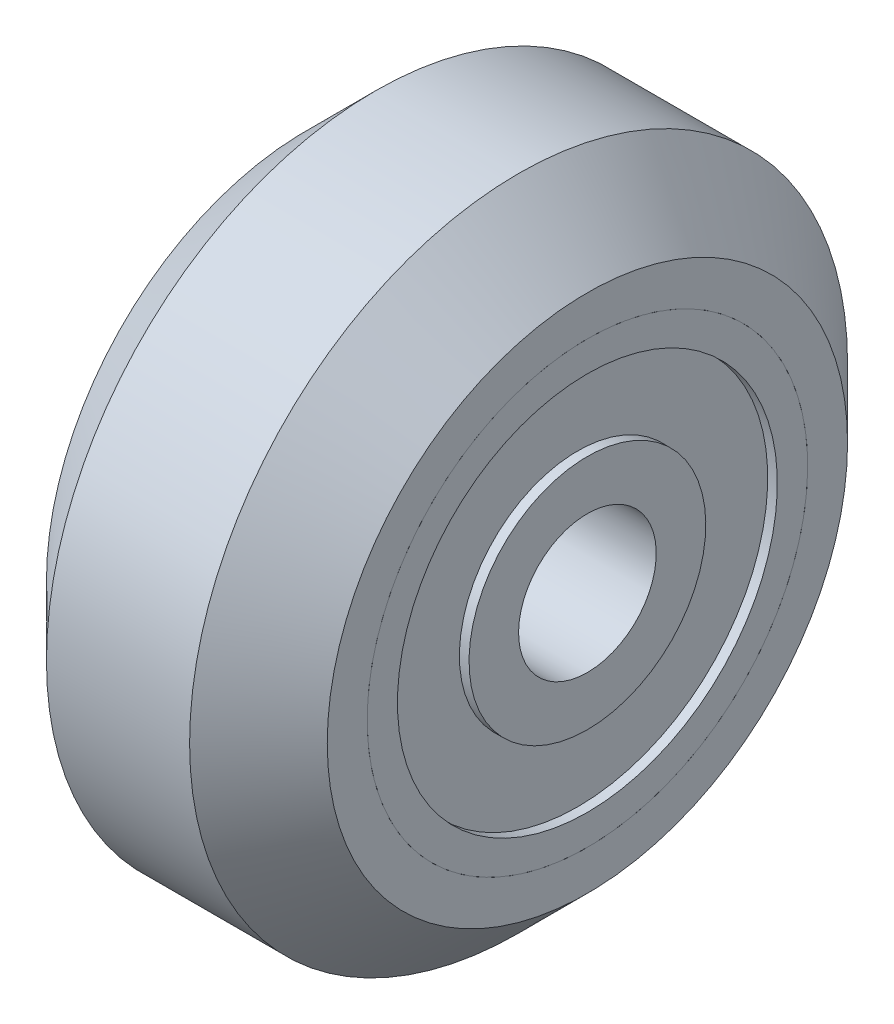
ISO-10303-21;
HEADER;
FILE_DESCRIPTION(('STEP AP214'),'2;1');
FILE_NAME('part.step','',(''),(''),'','','');
FILE_SCHEMA(('AUTOMOTIVE_DESIGN { 1 0 10303 214 1 1 1 1 }'));
ENDSEC;
DATA;
#1=APPLICATION_CONTEXT('core data for automotive mechanical design processes');
#2=APPLICATION_PROTOCOL_DEFINITION('international standard','automotive_design',2000,#1);
#3=PRODUCT_CONTEXT('',#1,'mechanical');
#4=PRODUCT('Part','Part','',(#3));
#5=PRODUCT_RELATED_PRODUCT_CATEGORY('part','',(#4));
#6=PRODUCT_DEFINITION_FORMATION('','',#4);
#7=PRODUCT_DEFINITION_CONTEXT('part definition',#1,'design');
#8=PRODUCT_DEFINITION('design','',#6,#7);
#9=PRODUCT_DEFINITION_SHAPE('','',#8);
#10=(LENGTH_UNIT() NAMED_UNIT(*) SI_UNIT(.MILLI.,.METRE.));
#11=(NAMED_UNIT(*) PLANE_ANGLE_UNIT() SI_UNIT($,.RADIAN.));
#12=(NAMED_UNIT(*) SI_UNIT($,.STERADIAN.) SOLID_ANGLE_UNIT());
#13=UNCERTAINTY_MEASURE_WITH_UNIT(LENGTH_MEASURE(1.E-05),#10,'distance_accuracy_value','');
#14=(GEOMETRIC_REPRESENTATION_CONTEXT(3) GLOBAL_UNCERTAINTY_ASSIGNED_CONTEXT((#13)) GLOBAL_UNIT_ASSIGNED_CONTEXT((#10,
#11,#12)) REPRESENTATION_CONTEXT('',''));
#15=CARTESIAN_POINT('',(0.,0.,0.));
#16=DIRECTION('',(0.,0.,1.));
#17=DIRECTION('',(1.,0.,0.));
#18=AXIS2_PLACEMENT_3D('',#15,#16,#17);
#19=CARTESIAN_POINT('',(-0.0999999999999964,-1.52706259721963,7.85290263687083));
#20=DIRECTION('',(-1.,0.,0.));
#21=DIRECTION('',(0.,-0.981612829608854,-0.190882824652454));
#22=AXIS2_PLACEMENT_3D('',#19,#20,#21);
#23=PLANE('',#22);
#24=CARTESIAN_POINT('',(-0.0999999999999964,0.,0.));
#25=DIRECTION('',(-1.,0.,0.));
#26=DIRECTION('',(0.,-0.981612829608854,-0.190882824652454));
#27=AXIS2_PLACEMENT_3D('',#24,#25,#26);
#28=CIRCLE('',#27,8.);
#29=CARTESIAN_POINT('',(-0.0999999999999962,-7.85290263687083,-1.52706259721963));
#30=VERTEX_POINT('',#29);
#31=EDGE_CURVE('P0_E54',#30,#30,#28,.T.);
#32=ORIENTED_EDGE('',*,*,#31,.F.);
#33=EDGE_LOOP('',(#32));
#34=FACE_BOUND('',#33,.T.);
#35=CARTESIAN_POINT('',(-0.0999999999999964,0.,0.));
#36=DIRECTION('',(-1.,0.,0.));
#37=DIRECTION('',(0.,-0.981612829608854,-0.190882824652454));
#38=AXIS2_PLACEMENT_3D('',#35,#36,#37);
#39=CIRCLE('',#38,6.9);
#40=CARTESIAN_POINT('',(-0.0999999999999962,-6.77312852430109,-1.31709149010193));
#41=VERTEX_POINT('',#40);
#42=EDGE_CURVE('P0_E9',#41,#41,#39,.T.);
#43=ORIENTED_EDGE('',*,*,#42,.T.);
#44=EDGE_LOOP('',(#43));
#45=FACE_BOUND('',#44,.T.);
#46=ADVANCED_FACE('P0_F14',(#34,#45),#23,.F.);
#47=CARTESIAN_POINT('',(-14.6286738351254,0.,0.));
#48=DIRECTION('',(-1.,0.,0.));
#49=DIRECTION('',(0.,-0.981612829608854,-0.190882824652454));
#50=AXIS2_PLACEMENT_3D('',#47,#48,#49);
#51=CYLINDRICAL_SURFACE('',#50,6.9);
#52=ORIENTED_EDGE('',*,*,#42,.F.);
#53=EDGE_LOOP('',(#52));
#54=FACE_BOUND('',#53,.T.);
#55=CARTESIAN_POINT('',(-0.449999999999996,0.,0.));
#56=DIRECTION('',(-1.,0.,0.));
#57=DIRECTION('',(0.,-0.981612829608854,-0.190882824652454));
#58=AXIS2_PLACEMENT_3D('',#55,#56,#57);
#59=CIRCLE('',#58,6.9);
#60=CARTESIAN_POINT('',(-0.449999999999996,-6.77312852430109,-1.31709149010193));
#61=VERTEX_POINT('',#60);
#62=EDGE_CURVE('P0_E20',#61,#61,#59,.T.);
#63=ORIENTED_EDGE('',*,*,#62,.T.);
#64=EDGE_LOOP('',(#63));
#65=FACE_BOUND('',#64,.T.);
#66=ADVANCED_FACE('P0_F61',(#54,#65),#51,.F.);
#67=CARTESIAN_POINT('',(-0.449999999999997,-1.31709149010193,6.77312852430109));
#68=DIRECTION('',(-1.,0.,0.));
#69=DIRECTION('',(0.,-0.981612829608854,-0.190882824652454));
#70=AXIS2_PLACEMENT_3D('',#67,#68,#69);
#71=PLANE('',#70);
#72=ORIENTED_EDGE('',*,*,#62,.F.);
#73=EDGE_LOOP('',(#72));
#74=FACE_BOUND('',#73,.T.);
#75=CARTESIAN_POINT('',(-0.449999999999996,0.,0.));
#76=DIRECTION('',(-1.,0.,0.));
#77=DIRECTION('',(0.,-0.981612829608854,-0.190882824652454));
#78=AXIS2_PLACEMENT_3D('',#75,#76,#77);
#79=CIRCLE('',#78,4.3);
#80=CARTESIAN_POINT('',(-0.449999999999996,-4.22093516731807,-0.820796146005553));
#81=VERTEX_POINT('',#80);
#82=EDGE_CURVE('P0_E24',#81,#81,#79,.T.);
#83=ORIENTED_EDGE('',*,*,#82,.T.);
#84=EDGE_LOOP('',(#83));
#85=FACE_BOUND('',#84,.T.);
#86=ADVANCED_FACE('P0_F66',(#74,#85),#71,.F.);
#87=CARTESIAN_POINT('',(-14.6286738351254,0.,0.));
#88=DIRECTION('',(-1.,0.,0.));
#89=DIRECTION('',(0.,-0.981612829608854,-0.190882824652454));
#90=AXIS2_PLACEMENT_3D('',#87,#88,#89);
#91=CYLINDRICAL_SURFACE('',#90,4.3);
#92=ORIENTED_EDGE('',*,*,#82,.F.);
#93=EDGE_LOOP('',(#92));
#94=FACE_BOUND('',#93,.T.);
#95=CARTESIAN_POINT('',(-0.0999999999999964,0.,0.));
#96=DIRECTION('',(-1.,0.,0.));
#97=DIRECTION('',(0.,-0.981612829608854,-0.190882824652454));
#98=AXIS2_PLACEMENT_3D('',#95,#96,#97);
#99=CIRCLE('',#98,4.3);
#100=CARTESIAN_POINT('',(-0.0999999999999963,-4.22093516731807,-0.820796146005553));
#101=VERTEX_POINT('',#100);
#102=EDGE_CURVE('P0_E28',#101,#101,#99,.T.);
#103=ORIENTED_EDGE('',*,*,#102,.T.);
#104=EDGE_LOOP('',(#103));
#105=FACE_BOUND('',#104,.T.);
#106=ADVANCED_FACE('P0_F71',(#94,#105),#91,.T.);
#107=CARTESIAN_POINT('',(-0.0999999999999955,-0.820796146005553,4.22093516731807));
#108=DIRECTION('',(-1.,0.,0.));
#109=DIRECTION('',(0.,-0.981612829608854,-0.190882824652454));
#110=AXIS2_PLACEMENT_3D('',#107,#108,#109);
#111=PLANE('',#110);
#112=ORIENTED_EDGE('',*,*,#102,.F.);
#113=EDGE_LOOP('',(#112));
#114=FACE_BOUND('',#113,.T.);
#115=CARTESIAN_POINT('',(-0.0999999999999964,0.,0.));
#116=DIRECTION('',(-1.,0.,0.));
#117=DIRECTION('',(0.,-0.981612829608854,-0.190882824652454));
#118=AXIS2_PLACEMENT_3D('',#115,#116,#117);
#119=CIRCLE('',#118,2.5);
#120=CARTESIAN_POINT('',(-0.0999999999999963,-2.45403207402213,-0.477207061631135));
#121=VERTEX_POINT('',#120);
#122=EDGE_CURVE('P0_E33',#121,#121,#119,.T.);
#123=ORIENTED_EDGE('',*,*,#122,.T.);
#124=EDGE_LOOP('',(#123));
#125=FACE_BOUND('',#124,.T.);
#126=ADVANCED_FACE('P0_F77',(#114,#125),#111,.F.);
#127=CARTESIAN_POINT('',(-14.6286738351254,0.,0.));
#128=DIRECTION('',(-1.,0.,0.));
#129=DIRECTION('',(0.,-0.981612829608854,-0.190882824652454));
#130=AXIS2_PLACEMENT_3D('',#127,#128,#129);
#131=CYLINDRICAL_SURFACE('',#130,2.5);
#132=ORIENTED_EDGE('',*,*,#122,.F.);
#133=EDGE_LOOP('',(#132));
#134=FACE_BOUND('',#133,.T.);
#135=CARTESIAN_POINT('',(-5.1,0.,0.));
#136=DIRECTION('',(-1.,0.,0.));
#137=DIRECTION('',(0.,-0.981612829608854,-0.190882824652454));
#138=AXIS2_PLACEMENT_3D('',#135,#136,#137);
#139=CIRCLE('',#138,2.5);
#140=CARTESIAN_POINT('',(-5.1,-2.45403207402213,-0.477207061631135));
#141=VERTEX_POINT('',#140);
#142=EDGE_CURVE('P0_E36',#141,#141,#139,.T.);
#143=ORIENTED_EDGE('',*,*,#142,.T.);
#144=EDGE_LOOP('',(#143));
#145=FACE_BOUND('',#144,.T.);
#146=ADVANCED_FACE('P0_F81',(#134,#145),#131,.F.);
#147=CARTESIAN_POINT('',(-5.1,-0.820796146005553,4.22093516731807));
#148=DIRECTION('',(1.,0.,0.));
#149=DIRECTION('',(0.,0.981612829608854,0.190882824652454));
#150=AXIS2_PLACEMENT_3D('',#147,#148,#149);
#151=PLANE('',#150);
#152=ORIENTED_EDGE('',*,*,#142,.F.);
#153=EDGE_LOOP('',(#152));
#154=FACE_BOUND('',#153,.T.);
#155=CARTESIAN_POINT('',(-5.1,0.,0.));
#156=DIRECTION('',(-1.,0.,0.));
#157=DIRECTION('',(0.,-0.981612829608854,-0.190882824652454));
#158=AXIS2_PLACEMENT_3D('',#155,#156,#157);
#159=CIRCLE('',#158,4.3);
#160=CARTESIAN_POINT('',(-5.1,-4.22093516731807,-0.820796146005553));
#161=VERTEX_POINT('',#160);
#162=EDGE_CURVE('P0_E39',#161,#161,#159,.T.);
#163=ORIENTED_EDGE('',*,*,#162,.T.);
#164=EDGE_LOOP('',(#163));
#165=FACE_BOUND('',#164,.T.);
#166=ADVANCED_FACE('P0_F85',(#154,#165),#151,.F.);
#167=CARTESIAN_POINT('',(-14.6286738351254,0.,0.));
#168=DIRECTION('',(-1.,0.,0.));
#169=DIRECTION('',(0.,-0.981612829608854,-0.190882824652454));
#170=AXIS2_PLACEMENT_3D('',#167,#168,#169);
#171=CYLINDRICAL_SURFACE('',#170,4.3);
#172=ORIENTED_EDGE('',*,*,#162,.F.);
#173=EDGE_LOOP('',(#172));
#174=FACE_BOUND('',#173,.T.);
#175=CARTESIAN_POINT('',(-4.75,0.,0.));
#176=DIRECTION('',(-1.,0.,0.));
#177=DIRECTION('',(0.,-0.981612829608854,-0.190882824652454));
#178=AXIS2_PLACEMENT_3D('',#175,#176,#177);
#179=CIRCLE('',#178,4.3);
#180=CARTESIAN_POINT('',(-4.75,-4.22093516731807,-0.820796146005553));
#181=VERTEX_POINT('',#180);
#182=EDGE_CURVE('P0_E42',#181,#181,#179,.T.);
#183=ORIENTED_EDGE('',*,*,#182,.T.);
#184=EDGE_LOOP('',(#183));
#185=FACE_BOUND('',#184,.T.);
#186=ADVANCED_FACE('P0_F89',(#174,#185),#171,.T.);
#187=CARTESIAN_POINT('',(-4.75,-1.31709149010193,6.77312852430109));
#188=DIRECTION('',(1.,0.,0.));
#189=DIRECTION('',(0.,0.981612829608854,0.190882824652454));
#190=AXIS2_PLACEMENT_3D('',#187,#188,#189);
#191=PLANE('',#190);
#192=ORIENTED_EDGE('',*,*,#182,.F.);
#193=EDGE_LOOP('',(#192));
#194=FACE_BOUND('',#193,.T.);
#195=CARTESIAN_POINT('',(-4.75,0.,0.));
#196=DIRECTION('',(-1.,0.,0.));
#197=DIRECTION('',(0.,-0.981612829608854,-0.190882824652454));
#198=AXIS2_PLACEMENT_3D('',#195,#196,#197);
#199=CIRCLE('',#198,6.9);
#200=CARTESIAN_POINT('',(-4.75,-6.77312852430109,-1.31709149010193));
#201=VERTEX_POINT('',#200);
#202=EDGE_CURVE('P0_E45',#201,#201,#199,.T.);
#203=ORIENTED_EDGE('',*,*,#202,.T.);
#204=EDGE_LOOP('',(#203));
#205=FACE_BOUND('',#204,.T.);
#206=ADVANCED_FACE('P0_F93',(#194,#205),#191,.F.);
#207=CARTESIAN_POINT('',(-14.6286738351254,0.,0.));
#208=DIRECTION('',(-1.,0.,0.));
#209=DIRECTION('',(0.,-0.981612829608854,-0.190882824652454));
#210=AXIS2_PLACEMENT_3D('',#207,#208,#209);
#211=CYLINDRICAL_SURFACE('',#210,6.9);
#212=ORIENTED_EDGE('',*,*,#202,.F.);
#213=EDGE_LOOP('',(#212));
#214=FACE_BOUND('',#213,.T.);
#215=CARTESIAN_POINT('',(-5.1,0.,0.));
#216=DIRECTION('',(-1.,0.,0.));
#217=DIRECTION('',(0.,-0.981612829608854,-0.190882824652454));
#218=AXIS2_PLACEMENT_3D('',#215,#216,#217);
#219=CIRCLE('',#218,6.9);
#220=CARTESIAN_POINT('',(-5.1,-6.77312852430109,-1.31709149010193));
#221=VERTEX_POINT('',#220);
#222=EDGE_CURVE('P0_E48',#221,#221,#219,.T.);
#223=ORIENTED_EDGE('',*,*,#222,.T.);
#224=EDGE_LOOP('',(#223));
#225=FACE_BOUND('',#224,.T.);
#226=ADVANCED_FACE('P0_F97',(#214,#225),#211,.F.);
#227=CARTESIAN_POINT('',(-5.1,-1.52706259721963,7.85290263687083));
#228=DIRECTION('',(1.,0.,0.));
#229=DIRECTION('',(0.,0.981612829608854,0.190882824652454));
#230=AXIS2_PLACEMENT_3D('',#227,#228,#229);
#231=PLANE('',#230);
#232=ORIENTED_EDGE('',*,*,#222,.F.);
#233=EDGE_LOOP('',(#232));
#234=FACE_BOUND('',#233,.T.);
#235=CARTESIAN_POINT('',(-5.1,0.,0.));
#236=DIRECTION('',(-1.,0.,0.));
#237=DIRECTION('',(0.,-0.981612829608854,-0.190882824652454));
#238=AXIS2_PLACEMENT_3D('',#235,#236,#237);
#239=CIRCLE('',#238,8.);
#240=CARTESIAN_POINT('',(-5.1,-7.85290263687083,-1.52706259721963));
#241=VERTEX_POINT('',#240);
#242=EDGE_CURVE('P0_E51',#241,#241,#239,.T.);
#243=ORIENTED_EDGE('',*,*,#242,.T.);
#244=EDGE_LOOP('',(#243));
#245=FACE_BOUND('',#244,.T.);
#246=ADVANCED_FACE('P0_F101',(#234,#245),#231,.F.);
#247=CARTESIAN_POINT('',(-14.6286738351254,0.,0.));
#248=DIRECTION('',(-1.,0.,0.));
#249=DIRECTION('',(0.,-0.981612829608854,-0.190882824652454));
#250=AXIS2_PLACEMENT_3D('',#247,#248,#249);
#251=CYLINDRICAL_SURFACE('',#250,8.);
#252=ORIENTED_EDGE('',*,*,#242,.F.);
#253=EDGE_LOOP('',(#252));
#254=FACE_BOUND('',#253,.T.);
#255=ORIENTED_EDGE('',*,*,#31,.T.);
#256=EDGE_LOOP('',(#255));
#257=FACE_BOUND('',#256,.T.);
#258=ADVANCED_FACE('P0_F58',(#254,#257),#251,.T.);
#259=CLOSED_SHELL('',(#46,#66,#86,#106,#126,#146,#166,#186,#206,#226,#246,#258));
#260=MANIFOLD_SOLID_BREP('P0_B1',#259);
#261=CARTESIAN_POINT('',(5.1,-1.41558802047038,-7.87376089021636));
#262=DIRECTION('',(-1.,0.,0.));
#263=DIRECTION('',(0.,0.984220111277045,-0.176948502558798));
#264=AXIS2_PLACEMENT_3D('',#261,#262,#263);
#265=PLANE('',#264);
#266=CARTESIAN_POINT('',(5.1,0.,0.));
#267=DIRECTION('',(-1.,0.,0.));
#268=DIRECTION('',(0.,0.984220111277045,-0.176948502558798));
#269=AXIS2_PLACEMENT_3D('',#266,#267,#268);
#270=CIRCLE('',#269,8.);
#271=CARTESIAN_POINT('',(5.1,7.87376089021636,-1.41558802047038));
#272=VERTEX_POINT('',#271);
#273=EDGE_CURVE('P1_E55',#272,#272,#270,.T.);
#274=ORIENTED_EDGE('',*,*,#273,.F.);
#275=EDGE_LOOP('',(#274));
#276=FACE_BOUND('',#275,.T.);
#277=CARTESIAN_POINT('',(5.1,0.,0.));
#278=DIRECTION('',(-1.,0.,0.));
#279=DIRECTION('',(0.,0.984220111277045,-0.176948502558798));
#280=AXIS2_PLACEMENT_3D('',#277,#278,#279);
#281=CIRCLE('',#280,6.9);
#282=CARTESIAN_POINT('',(5.1,6.79111876781161,-1.2209446676557));
#283=VERTEX_POINT('',#282);
#284=EDGE_CURVE('P1_E10',#283,#283,#281,.T.);
#285=ORIENTED_EDGE('',*,*,#284,.T.);
#286=EDGE_LOOP('',(#285));
#287=FACE_BOUND('',#286,.T.);
#288=ADVANCED_FACE('P1_F15',(#276,#287),#265,.F.);
#289=CARTESIAN_POINT('',(-9.42867383512545,0.,0.));
#290=DIRECTION('',(-1.,0.,0.));
#291=DIRECTION('',(0.,0.984220111277045,-0.176948502558798));
#292=AXIS2_PLACEMENT_3D('',#289,#290,#291);
#293=CYLINDRICAL_SURFACE('',#292,6.9);
#294=ORIENTED_EDGE('',*,*,#284,.F.);
#295=EDGE_LOOP('',(#294));
#296=FACE_BOUND('',#295,.T.);
#297=CARTESIAN_POINT('',(4.75,0.,0.));
#298=DIRECTION('',(-1.,0.,0.));
#299=DIRECTION('',(0.,0.984220111277045,-0.176948502558798));
#300=AXIS2_PLACEMENT_3D('',#297,#298,#299);
#301=CIRCLE('',#300,6.9);
#302=CARTESIAN_POINT('',(4.75,6.79111876781161,-1.2209446676557));
#303=VERTEX_POINT('',#302);
#304=EDGE_CURVE('P1_E21',#303,#303,#301,.T.);
#305=ORIENTED_EDGE('',*,*,#304,.T.);
#306=EDGE_LOOP('',(#305));
#307=FACE_BOUND('',#306,.T.);
#308=ADVANCED_FACE('P1_F62',(#296,#307),#293,.F.);
#309=CARTESIAN_POINT('',(4.75,-1.2209446676557,-6.79111876781161));
#310=DIRECTION('',(-1.,0.,0.));
#311=DIRECTION('',(0.,0.984220111277045,-0.176948502558798));
#312=AXIS2_PLACEMENT_3D('',#309,#310,#311);
#313=PLANE('',#312);
#314=ORIENTED_EDGE('',*,*,#304,.F.);
#315=EDGE_LOOP('',(#314));
#316=FACE_BOUND('',#315,.T.);
#317=CARTESIAN_POINT('',(4.75,0.,0.));
#318=DIRECTION('',(-1.,0.,0.));
#319=DIRECTION('',(0.,0.984220111277045,-0.176948502558798));
#320=AXIS2_PLACEMENT_3D('',#317,#318,#319);
#321=CIRCLE('',#320,4.3);
#322=CARTESIAN_POINT('',(4.75,4.23214647849129,-0.76087856100283));
#323=VERTEX_POINT('',#322);
#324=EDGE_CURVE('P1_E25',#323,#323,#321,.T.);
#325=ORIENTED_EDGE('',*,*,#324,.T.);
#326=EDGE_LOOP('',(#325));
#327=FACE_BOUND('',#326,.T.);
#328=ADVANCED_FACE('P1_F67',(#316,#327),#313,.F.);
#329=CARTESIAN_POINT('',(-9.42867383512545,0.,0.));
#330=DIRECTION('',(-1.,0.,0.));
#331=DIRECTION('',(0.,0.984220111277045,-0.176948502558798));
#332=AXIS2_PLACEMENT_3D('',#329,#330,#331);
#333=CYLINDRICAL_SURFACE('',#332,4.3);
#334=ORIENTED_EDGE('',*,*,#324,.F.);
#335=EDGE_LOOP('',(#334));
#336=FACE_BOUND('',#335,.T.);
#337=CARTESIAN_POINT('',(5.1,0.,0.));
#338=DIRECTION('',(-1.,0.,0.));
#339=DIRECTION('',(0.,0.984220111277045,-0.176948502558798));
#340=AXIS2_PLACEMENT_3D('',#337,#338,#339);
#341=CIRCLE('',#340,4.3);
#342=CARTESIAN_POINT('',(5.1,4.23214647849129,-0.76087856100283));
#343=VERTEX_POINT('',#342);
#344=EDGE_CURVE('P1_E29',#343,#343,#341,.T.);
#345=ORIENTED_EDGE('',*,*,#344,.T.);
#346=EDGE_LOOP('',(#345));
#347=FACE_BOUND('',#346,.T.);
#348=ADVANCED_FACE('P1_F72',(#336,#347),#333,.T.);
#349=CARTESIAN_POINT('',(5.1,-0.76087856100283,-4.23214647849129));
#350=DIRECTION('',(-1.,0.,0.));
#351=DIRECTION('',(0.,0.984220111277045,-0.176948502558798));
#352=AXIS2_PLACEMENT_3D('',#349,#350,#351);
#353=PLANE('',#352);
#354=ORIENTED_EDGE('',*,*,#344,.F.);
#355=EDGE_LOOP('',(#354));
#356=FACE_BOUND('',#355,.T.);
#357=CARTESIAN_POINT('',(5.1,0.,0.));
#358=DIRECTION('',(-1.,0.,0.));
#359=DIRECTION('',(0.,0.984220111277045,-0.176948502558798));
#360=AXIS2_PLACEMENT_3D('',#357,#358,#359);
#361=CIRCLE('',#360,2.5);
#362=CARTESIAN_POINT('',(5.1,2.46055027819261,-0.442371256396994));
#363=VERTEX_POINT('',#362);
#364=EDGE_CURVE('P1_E34',#363,#363,#361,.T.);
#365=ORIENTED_EDGE('',*,*,#364,.T.);
#366=EDGE_LOOP('',(#365));
#367=FACE_BOUND('',#366,.T.);
#368=ADVANCED_FACE('P1_F78',(#356,#367),#353,.F.);
#369=CARTESIAN_POINT('',(-9.42867383512545,0.,0.));
#370=DIRECTION('',(-1.,0.,0.));
#371=DIRECTION('',(0.,0.984220111277045,-0.176948502558798));
#372=AXIS2_PLACEMENT_3D('',#369,#370,#371);
#373=CYLINDRICAL_SURFACE('',#372,2.5);
#374=ORIENTED_EDGE('',*,*,#364,.F.);
#375=EDGE_LOOP('',(#374));
#376=FACE_BOUND('',#375,.T.);
#377=CARTESIAN_POINT('',(0.0999999999999972,0.,0.));
#378=DIRECTION('',(-1.,0.,0.));
#379=DIRECTION('',(0.,0.984220111277045,-0.176948502558798));
#380=AXIS2_PLACEMENT_3D('',#377,#378,#379);
#381=CIRCLE('',#380,2.5);
#382=CARTESIAN_POINT('',(0.0999999999999972,2.46055027819261,-0.442371256396994));
#383=VERTEX_POINT('',#382);
#384=EDGE_CURVE('P1_E37',#383,#383,#381,.T.);
#385=ORIENTED_EDGE('',*,*,#384,.T.);
#386=EDGE_LOOP('',(#385));
#387=FACE_BOUND('',#386,.T.);
#388=ADVANCED_FACE('P1_F82',(#376,#387),#373,.F.);
#389=CARTESIAN_POINT('',(0.0999999999999964,-0.76087856100283,-4.23214647849129));
#390=DIRECTION('',(1.,0.,0.));
#391=DIRECTION('',(0.,-0.984220111277045,0.176948502558798));
#392=AXIS2_PLACEMENT_3D('',#389,#390,#391);
#393=PLANE('',#392);
#394=ORIENTED_EDGE('',*,*,#384,.F.);
#395=EDGE_LOOP('',(#394));
#396=FACE_BOUND('',#395,.T.);
#397=CARTESIAN_POINT('',(0.0999999999999972,0.,0.));
#398=DIRECTION('',(-1.,0.,0.));
#399=DIRECTION('',(0.,0.984220111277045,-0.176948502558798));
#400=AXIS2_PLACEMENT_3D('',#397,#398,#399);
#401=CIRCLE('',#400,4.3);
#402=CARTESIAN_POINT('',(0.0999999999999972,4.23214647849129,-0.76087856100283));
#403=VERTEX_POINT('',#402);
#404=EDGE_CURVE('P1_E40',#403,#403,#401,.T.);
#405=ORIENTED_EDGE('',*,*,#404,.T.);
#406=EDGE_LOOP('',(#405));
#407=FACE_BOUND('',#406,.T.);
#408=ADVANCED_FACE('P1_F86',(#396,#407),#393,.F.);
#409=CARTESIAN_POINT('',(-9.42867383512545,0.,0.));
#410=DIRECTION('',(-1.,0.,0.));
#411=DIRECTION('',(0.,0.984220111277045,-0.176948502558798));
#412=AXIS2_PLACEMENT_3D('',#409,#410,#411);
#413=CYLINDRICAL_SURFACE('',#412,4.3);
#414=ORIENTED_EDGE('',*,*,#404,.F.);
#415=EDGE_LOOP('',(#414));
#416=FACE_BOUND('',#415,.T.);
#417=CARTESIAN_POINT('',(0.449999999999997,0.,0.));
#418=DIRECTION('',(-1.,0.,0.));
#419=DIRECTION('',(0.,0.984220111277045,-0.176948502558798));
#420=AXIS2_PLACEMENT_3D('',#417,#418,#419);
#421=CIRCLE('',#420,4.3);
#422=CARTESIAN_POINT('',(0.449999999999997,4.23214647849129,-0.76087856100283));
#423=VERTEX_POINT('',#422);
#424=EDGE_CURVE('P1_E43',#423,#423,#421,.T.);
#425=ORIENTED_EDGE('',*,*,#424,.T.);
#426=EDGE_LOOP('',(#425));
#427=FACE_BOUND('',#426,.T.);
#428=ADVANCED_FACE('P1_F90',(#416,#427),#413,.T.);
#429=CARTESIAN_POINT('',(0.449999999999998,-1.2209446676557,-6.79111876781161));
#430=DIRECTION('',(1.,0.,0.));
#431=DIRECTION('',(0.,-0.984220111277045,0.176948502558798));
#432=AXIS2_PLACEMENT_3D('',#429,#430,#431);
#433=PLANE('',#432);
#434=ORIENTED_EDGE('',*,*,#424,.F.);
#435=EDGE_LOOP('',(#434));
#436=FACE_BOUND('',#435,.T.);
#437=CARTESIAN_POINT('',(0.449999999999997,0.,0.));
#438=DIRECTION('',(-1.,0.,0.));
#439=DIRECTION('',(0.,0.984220111277045,-0.176948502558798));
#440=AXIS2_PLACEMENT_3D('',#437,#438,#439);
#441=CIRCLE('',#440,6.9);
#442=CARTESIAN_POINT('',(0.449999999999997,6.79111876781161,-1.2209446676557));
#443=VERTEX_POINT('',#442);
#444=EDGE_CURVE('P1_E46',#443,#443,#441,.T.);
#445=ORIENTED_EDGE('',*,*,#444,.T.);
#446=EDGE_LOOP('',(#445));
#447=FACE_BOUND('',#446,.T.);
#448=ADVANCED_FACE('P1_F94',(#436,#447),#433,.F.);
#449=CARTESIAN_POINT('',(-9.42867383512545,0.,0.));
#450=DIRECTION('',(-1.,0.,0.));
#451=DIRECTION('',(0.,0.984220111277045,-0.176948502558798));
#452=AXIS2_PLACEMENT_3D('',#449,#450,#451);
#453=CYLINDRICAL_SURFACE('',#452,6.9);
#454=ORIENTED_EDGE('',*,*,#444,.F.);
#455=EDGE_LOOP('',(#454));
#456=FACE_BOUND('',#455,.T.);
#457=CARTESIAN_POINT('',(0.0999999999999972,0.,0.));
#458=DIRECTION('',(-1.,0.,0.));
#459=DIRECTION('',(0.,0.984220111277045,-0.176948502558798));
#460=AXIS2_PLACEMENT_3D('',#457,#458,#459);
#461=CIRCLE('',#460,6.9);
#462=CARTESIAN_POINT('',(0.0999999999999972,6.79111876781161,-1.2209446676557));
#463=VERTEX_POINT('',#462);
#464=EDGE_CURVE('P1_E49',#463,#463,#461,.T.);
#465=ORIENTED_EDGE('',*,*,#464,.T.);
#466=EDGE_LOOP('',(#465));
#467=FACE_BOUND('',#466,.T.);
#468=ADVANCED_FACE('P1_F98',(#456,#467),#453,.F.);
#469=CARTESIAN_POINT('',(0.0999999999999977,-1.41558802047038,-7.87376089021636));
#470=DIRECTION('',(1.,0.,0.));
#471=DIRECTION('',(0.,-0.984220111277045,0.176948502558798));
#472=AXIS2_PLACEMENT_3D('',#469,#470,#471);
#473=PLANE('',#472);
#474=ORIENTED_EDGE('',*,*,#464,.F.);
#475=EDGE_LOOP('',(#474));
#476=FACE_BOUND('',#475,.T.);
#477=CARTESIAN_POINT('',(0.0999999999999972,0.,0.));
#478=DIRECTION('',(-1.,0.,0.));
#479=DIRECTION('',(0.,0.984220111277045,-0.176948502558798));
#480=AXIS2_PLACEMENT_3D('',#477,#478,#479);
#481=CIRCLE('',#480,8.);
#482=CARTESIAN_POINT('',(0.0999999999999971,7.87376089021636,-1.41558802047038));
#483=VERTEX_POINT('',#482);
#484=EDGE_CURVE('P1_E52',#483,#483,#481,.T.);
#485=ORIENTED_EDGE('',*,*,#484,.T.);
#486=EDGE_LOOP('',(#485));
#487=FACE_BOUND('',#486,.T.);
#488=ADVANCED_FACE('P1_F102',(#476,#487),#473,.F.);
#489=CARTESIAN_POINT('',(-9.42867383512545,0.,0.));
#490=DIRECTION('',(-1.,0.,0.));
#491=DIRECTION('',(0.,0.984220111277045,-0.176948502558798));
#492=AXIS2_PLACEMENT_3D('',#489,#490,#491);
#493=CYLINDRICAL_SURFACE('',#492,8.);
#494=ORIENTED_EDGE('',*,*,#484,.F.);
#495=EDGE_LOOP('',(#494));
#496=FACE_BOUND('',#495,.T.);
#497=ORIENTED_EDGE('',*,*,#273,.T.);
#498=EDGE_LOOP('',(#497));
#499=FACE_BOUND('',#498,.T.);
#500=ADVANCED_FACE('P1_F59',(#496,#499),#493,.T.);
#501=CLOSED_SHELL('',(#288,#308,#328,#348,#368,#388,#408,#428,#448,#468,#488,#500));
#502=MANIFOLD_SOLID_BREP('P1_B1',#501);
#503=CARTESIAN_POINT('',(0.500000000000001,0.,0.));
#504=DIRECTION('',(-1.,0.,0.));
#505=DIRECTION('',(0.,-0.987550545246947,-0.157302004381565));
#506=AXIS2_PLACEMENT_3D('',#503,#504,#505);
#507=CYLINDRICAL_SURFACE('',#506,2.6);
#508=CARTESIAN_POINT('',(0.500000000000001,0.,0.));
#509=DIRECTION('',(-1.,0.,0.));
#510=DIRECTION('',(0.,-0.987550545246947,-0.157302004381565));
#511=AXIS2_PLACEMENT_3D('',#508,#509,#510);
#512=CIRCLE('',#511,2.6);
#513=CARTESIAN_POINT('',(0.500000000000001,2.56763141764206,0.408985211392067));
#514=VERTEX_POINT('',#513);
#515=EDGE_CURVE('P2_E39',#514,#514,#512,.T.);
#516=ORIENTED_EDGE('',*,*,#515,.F.);
#517=DIRECTION('',(-1.,0.,0.));
#518=VECTOR('',#517,1.);
#519=CARTESIAN_POINT('',(0.500000000000001,2.56763141764206,0.408985211392067));
#520=LINE('',#519,#518);
#521=CARTESIAN_POINT('',(-0.499999999999999,2.56763141764206,0.408985211392067));
#522=VERTEX_POINT('',#521);
#523=EDGE_CURVE('P2_E11',#514,#522,#520,.T.);
#524=ORIENTED_EDGE('',*,*,#523,.T.);
#525=CARTESIAN_POINT('',(-0.499999999999999,0.,0.));
#526=DIRECTION('',(1.,0.,0.));
#527=DIRECTION('',(0.,-0.987550545246947,-0.157302004381565));
#528=AXIS2_PLACEMENT_3D('',#525,#526,#527);
#529=CIRCLE('',#528,2.6);
#530=EDGE_CURVE('P2_E69',#522,#522,#529,.T.);
#531=ORIENTED_EDGE('',*,*,#530,.F.);
#532=ORIENTED_EDGE('',*,*,#523,.F.);
#533=EDGE_LOOP('',(#516,#524,#531,#532));
#534=FACE_BOUND('',#533,.T.);
#535=ADVANCED_FACE('P2_F17',(#534),#507,.F.);
#536=CARTESIAN_POINT('',(0.500000000000001,0.,0.));
#537=DIRECTION('',(-1.,0.,0.));
#538=DIRECTION('',(0.,-0.987550545246947,-0.157302004381565));
#539=AXIS2_PLACEMENT_3D('',#536,#537,#538);
#540=CYLINDRICAL_SURFACE('',#539,5.);
#541=CARTESIAN_POINT('',(-0.499999999999999,0.,0.));
#542=DIRECTION('',(-1.,0.,0.));
#543=DIRECTION('',(0.,-0.987550545246947,-0.157302004381565));
#544=AXIS2_PLACEMENT_3D('',#541,#542,#543);
#545=CIRCLE('',#544,5.);
#546=CARTESIAN_POINT('',(-0.499999999999999,4.93775272623474,0.786510021907823));
#547=VERTEX_POINT('',#546);
#548=EDGE_CURVE('P2_E52',#547,#547,#545,.T.);
#549=ORIENTED_EDGE('',*,*,#548,.F.);
#550=DIRECTION('',(1.,0.,0.));
#551=VECTOR('',#550,1.);
#552=CARTESIAN_POINT('',(0.500000000000001,4.93775272623474,0.786510021907823));
#553=LINE('',#552,#551);
#554=CARTESIAN_POINT('',(0.500000000000001,4.93775272623474,0.786510021907823));
#555=VERTEX_POINT('',#554);
#556=EDGE_CURVE('P2_E21',#547,#555,#553,.T.);
#557=ORIENTED_EDGE('',*,*,#556,.T.);
#558=CARTESIAN_POINT('',(0.500000000000001,0.,0.));
#559=DIRECTION('',(1.,0.,0.));
#560=DIRECTION('',(0.,-0.987550545246947,-0.157302004381565));
#561=AXIS2_PLACEMENT_3D('',#558,#559,#560);
#562=CIRCLE('',#561,5.);
#563=EDGE_CURVE('P2_E57',#555,#555,#562,.T.);
#564=ORIENTED_EDGE('',*,*,#563,.F.);
#565=ORIENTED_EDGE('',*,*,#556,.F.);
#566=EDGE_LOOP('',(#549,#557,#564,#565));
#567=FACE_BOUND('',#566,.T.);
#568=ADVANCED_FACE('P2_F58',(#567),#540,.T.);
#569=CARTESIAN_POINT('',(0.500000000000001,0.,0.));
#570=DIRECTION('',(-1.,0.,0.));
#571=DIRECTION('',(0.,0.987550545246947,0.157302004381565));
#572=AXIS2_PLACEMENT_3D('',#569,#570,#571);
#573=PLANE('',#572);
#574=ORIENTED_EDGE('',*,*,#563,.T.);
#575=EDGE_LOOP('',(#574));
#576=FACE_BOUND('',#575,.T.);
#577=ORIENTED_EDGE('',*,*,#515,.T.);
#578=EDGE_LOOP('',(#577));
#579=FACE_BOUND('',#578,.T.);
#580=ADVANCED_FACE('P2_F80',(#576,#579),#573,.F.);
#581=CARTESIAN_POINT('',(-0.499999999999999,0.,0.));
#582=DIRECTION('',(-1.,0.,0.));
#583=DIRECTION('',(0.,0.987550545246947,0.157302004381565));
#584=AXIS2_PLACEMENT_3D('',#581,#582,#583);
#585=PLANE('',#584);
#586=ORIENTED_EDGE('',*,*,#548,.T.);
#587=EDGE_LOOP('',(#586));
#588=FACE_BOUND('',#587,.T.);
#589=ORIENTED_EDGE('',*,*,#530,.T.);
#590=EDGE_LOOP('',(#589));
#591=FACE_BOUND('',#590,.T.);
#592=ADVANCED_FACE('P2_F19',(#588,#591),#585,.T.);
#593=CLOSED_SHELL('',(#535,#568,#580,#592));
#594=MANIFOLD_SOLID_BREP('P2_B1',#593);
#595=CARTESIAN_POINT('',(-5.1,0.,0.));
#596=DIRECTION('',(1.,0.,0.));
#597=DIRECTION('',(0.,0.,-1.));
#598=AXIS2_PLACEMENT_3D('',#595,#596,#597);
#599=PLANE('',#598);
#600=CARTESIAN_POINT('',(-5.1,0.,0.));
#601=DIRECTION('',(1.,0.,0.));
#602=DIRECTION('',(0.,0.,-1.));
#603=AXIS2_PLACEMENT_3D('',#600,#601,#602);
#604=CIRCLE('',#603,9.44999999999999);
#605=CARTESIAN_POINT('',(-5.1,0.,-9.44999999999999));
#606=VERTEX_POINT('',#605);
#607=EDGE_CURVE('P3_E22',#606,#606,#604,.F.);
#608=ORIENTED_EDGE('',*,*,#607,.T.);
#609=EDGE_LOOP('',(#608));
#610=FACE_BOUND('',#609,.T.);
#611=CARTESIAN_POINT('',(-5.1,0.,0.));
#612=DIRECTION('',(1.,0.,0.));
#613=DIRECTION('',(0.,0.,-1.));
#614=AXIS2_PLACEMENT_3D('',#611,#612,#613);
#615=CIRCLE('',#614,8.);
#616=CARTESIAN_POINT('',(-5.1,0.,-8.));
#617=VERTEX_POINT('',#616);
#618=EDGE_CURVE('P3_E39',#617,#617,#615,.T.);
#619=ORIENTED_EDGE('',*,*,#618,.T.);
#620=EDGE_LOOP('',(#619));
#621=FACE_BOUND('',#620,.T.);
#622=ADVANCED_FACE('P3_F15',(#610,#621),#599,.F.);
#623=CARTESIAN_POINT('',(5.1,0.,0.));
#624=DIRECTION('',(-1.,0.,0.));
#625=DIRECTION('',(0.,0.,1.));
#626=AXIS2_PLACEMENT_3D('',#623,#624,#625);
#627=CYLINDRICAL_SURFACE('',#626,11.95);
#628=CARTESIAN_POINT('',(-2.59999999999999,0.,0.));
#629=DIRECTION('',(1.,0.,0.));
#630=DIRECTION('',(0.,0.,-1.));
#631=AXIS2_PLACEMENT_3D('',#628,#629,#630);
#632=CIRCLE('',#631,11.95);
#633=CARTESIAN_POINT('',(-2.59999999999999,0.,-11.95));
#634=VERTEX_POINT('',#633);
#635=EDGE_CURVE('P3_E26',#634,#634,#632,.T.);
#636=ORIENTED_EDGE('',*,*,#635,.T.);
#637=EDGE_LOOP('',(#636));
#638=FACE_BOUND('',#637,.T.);
#639=CARTESIAN_POINT('',(2.6,0.,0.));
#640=DIRECTION('',(1.,0.,0.));
#641=DIRECTION('',(0.,0.,-1.));
#642=AXIS2_PLACEMENT_3D('',#639,#640,#641);
#643=CIRCLE('',#642,11.95);
#644=CARTESIAN_POINT('',(2.6,0.,-11.95));
#645=VERTEX_POINT('',#644);
#646=EDGE_CURVE('P3_E30',#645,#645,#643,.F.);
#647=ORIENTED_EDGE('',*,*,#646,.T.);
#648=EDGE_LOOP('',(#647));
#649=FACE_BOUND('',#648,.T.);
#650=ADVANCED_FACE('P3_F71',(#638,#649),#627,.T.);
#651=CARTESIAN_POINT('',(5.1,0.,0.));
#652=DIRECTION('',(1.,0.,0.));
#653=DIRECTION('',(0.,0.,-1.));
#654=AXIS2_PLACEMENT_3D('',#651,#652,#653);
#655=PLANE('',#654);
#656=CARTESIAN_POINT('',(5.1,0.,0.));
#657=DIRECTION('',(1.,0.,0.));
#658=DIRECTION('',(0.,0.,-1.));
#659=AXIS2_PLACEMENT_3D('',#656,#657,#658);
#660=CIRCLE('',#659,9.45);
#661=CARTESIAN_POINT('',(5.1,0.,-9.45));
#662=VERTEX_POINT('',#661);
#663=EDGE_CURVE('P3_E10',#662,#662,#660,.T.);
#664=ORIENTED_EDGE('',*,*,#663,.T.);
#665=EDGE_LOOP('',(#664));
#666=FACE_BOUND('',#665,.T.);
#667=CARTESIAN_POINT('',(5.1,0.,0.));
#668=DIRECTION('',(1.,0.,0.));
#669=DIRECTION('',(0.,0.,-1.));
#670=AXIS2_PLACEMENT_3D('',#667,#668,#669);
#671=CIRCLE('',#670,8.);
#672=CARTESIAN_POINT('',(5.1,0.,-8.));
#673=VERTEX_POINT('',#672);
#674=EDGE_CURVE('P3_E41',#673,#673,#671,.T.);
#675=ORIENTED_EDGE('',*,*,#674,.F.);
#676=EDGE_LOOP('',(#675));
#677=FACE_BOUND('',#676,.T.);
#678=ADVANCED_FACE('P3_F66',(#666,#677),#655,.T.);
#679=CARTESIAN_POINT('',(0.399999999999999,0.,0.));
#680=DIRECTION('',(1.,0.,0.));
#681=DIRECTION('',(0.,0.,-1.));
#682=AXIS2_PLACEMENT_3D('',#679,#680,#681);
#683=CYLINDRICAL_SURFACE('',#682,8.);
#684=CARTESIAN_POINT('',(0.399999999999999,0.,0.));
#685=DIRECTION('',(1.,0.,0.));
#686=DIRECTION('',(0.,0.,-1.));
#687=AXIS2_PLACEMENT_3D('',#684,#685,#686);
#688=CIRCLE('',#687,8.);
#689=CARTESIAN_POINT('',(0.399999999999999,0.,-8.));
#690=VERTEX_POINT('',#689);
#691=EDGE_CURVE('P3_E35',#690,#690,#688,.T.);
#692=ORIENTED_EDGE('',*,*,#691,.F.);
#693=EDGE_LOOP('',(#692));
#694=FACE_BOUND('',#693,.T.);
#695=ORIENTED_EDGE('',*,*,#674,.T.);
#696=EDGE_LOOP('',(#695));
#697=FACE_BOUND('',#696,.T.);
#698=ADVANCED_FACE('P3_F60',(#694,#697),#683,.F.);
#699=CARTESIAN_POINT('',(0.399999999999999,0.,0.));
#700=DIRECTION('',(1.,0.,0.));
#701=DIRECTION('',(0.,0.,-1.));
#702=AXIS2_PLACEMENT_3D('',#699,#700,#701);
#703=PLANE('',#702);
#704=CARTESIAN_POINT('',(0.399999999999999,0.,0.));
#705=DIRECTION('',(1.,0.,0.));
#706=DIRECTION('',(0.,0.,-1.));
#707=AXIS2_PLACEMENT_3D('',#704,#705,#706);
#708=CIRCLE('',#707,7.);
#709=CARTESIAN_POINT('',(0.399999999999999,0.,-7.));
#710=VERTEX_POINT('',#709);
#711=EDGE_CURVE('P3_E40',#710,#710,#708,.T.);
#712=ORIENTED_EDGE('',*,*,#711,.F.);
#713=EDGE_LOOP('',(#712));
#714=FACE_BOUND('',#713,.T.);
#715=ORIENTED_EDGE('',*,*,#691,.T.);
#716=EDGE_LOOP('',(#715));
#717=FACE_BOUND('',#716,.T.);
#718=ADVANCED_FACE('P3_F56',(#714,#717),#703,.T.);
#719=CARTESIAN_POINT('',(-0.399999999999999,0.,0.));
#720=DIRECTION('',(-1.,0.,0.));
#721=DIRECTION('',(0.,0.,1.));
#722=AXIS2_PLACEMENT_3D('',#719,#720,#721);
#723=CYLINDRICAL_SURFACE('',#722,8.);
#724=CARTESIAN_POINT('',(-0.399999999999999,0.,0.));
#725=DIRECTION('',(1.,0.,0.));
#726=DIRECTION('',(0.,0.,-1.));
#727=AXIS2_PLACEMENT_3D('',#724,#725,#726);
#728=CIRCLE('',#727,8.);
#729=CARTESIAN_POINT('',(-0.399999999999999,0.,-8.));
#730=VERTEX_POINT('',#729);
#731=EDGE_CURVE('P3_E44',#730,#730,#728,.T.);
#732=ORIENTED_EDGE('',*,*,#731,.T.);
#733=EDGE_LOOP('',(#732));
#734=FACE_BOUND('',#733,.T.);
#735=ORIENTED_EDGE('',*,*,#618,.F.);
#736=EDGE_LOOP('',(#735));
#737=FACE_BOUND('',#736,.T.);
#738=ADVANCED_FACE('P3_F59',(#734,#737),#723,.F.);
#739=CARTESIAN_POINT('',(-0.399999999999999,0.,0.));
#740=DIRECTION('',(-1.,0.,0.));
#741=DIRECTION('',(0.,0.,-1.));
#742=AXIS2_PLACEMENT_3D('',#739,#740,#741);
#743=PLANE('',#742);
#744=CARTESIAN_POINT('',(-0.399999999999999,0.,0.));
#745=DIRECTION('',(-1.,0.,0.));
#746=DIRECTION('',(0.,0.,1.));
#747=AXIS2_PLACEMENT_3D('',#744,#745,#746);
#748=CIRCLE('',#747,7.);
#749=CARTESIAN_POINT('',(-0.399999999999999,0.,7.));
#750=VERTEX_POINT('',#749);
#751=EDGE_CURVE('P3_E36',#750,#750,#748,.T.);
#752=ORIENTED_EDGE('',*,*,#751,.F.);
#753=EDGE_LOOP('',(#752));
#754=FACE_BOUND('',#753,.T.);
#755=ORIENTED_EDGE('',*,*,#731,.F.);
#756=EDGE_LOOP('',(#755));
#757=FACE_BOUND('',#756,.T.);
#758=ADVANCED_FACE('P3_F92',(#754,#757),#743,.T.);
#759=CARTESIAN_POINT('',(-2.6,0.,0.));
#760=DIRECTION('',(1.,0.,0.));
#761=DIRECTION('',(0.,0.,-1.));
#762=AXIS2_PLACEMENT_3D('',#759,#760,#761);
#763=CYLINDRICAL_SURFACE('',#762,7.);
#764=ORIENTED_EDGE('',*,*,#751,.T.);
#765=EDGE_LOOP('',(#764));
#766=FACE_BOUND('',#765,.T.);
#767=ORIENTED_EDGE('',*,*,#711,.T.);
#768=EDGE_LOOP('',(#767));
#769=FACE_BOUND('',#768,.T.);
#770=ADVANCED_FACE('P3_F54',(#766,#769),#763,.F.);
#771=CARTESIAN_POINT('',(-2.59999999999999,0.,0.));
#772=DIRECTION('',(1.,0.,0.));
#773=DIRECTION('',(0.,0.,-1.));
#774=AXIS2_PLACEMENT_3D('',#771,#772,#773);
#775=CONICAL_SURFACE('',#774,11.95,0.785398163397448);
#776=ORIENTED_EDGE('',*,*,#607,.F.);
#777=EDGE_LOOP('',(#776));
#778=FACE_BOUND('',#777,.T.);
#779=ORIENTED_EDGE('',*,*,#635,.F.);
#780=EDGE_LOOP('',(#779));
#781=FACE_BOUND('',#780,.T.);
#782=ADVANCED_FACE('P3_F84',(#778,#781),#775,.T.);
#783=CARTESIAN_POINT('',(5.1,0.,0.));
#784=DIRECTION('',(-1.,0.,0.));
#785=DIRECTION('',(0.,0.,1.));
#786=AXIS2_PLACEMENT_3D('',#783,#784,#785);
#787=CONICAL_SURFACE('',#786,9.45,0.785398163397448);
#788=ORIENTED_EDGE('',*,*,#646,.F.);
#789=EDGE_LOOP('',(#788));
#790=FACE_BOUND('',#789,.T.);
#791=ORIENTED_EDGE('',*,*,#663,.F.);
#792=EDGE_LOOP('',(#791));
#793=FACE_BOUND('',#792,.T.);
#794=ADVANCED_FACE('P3_F17',(#790,#793),#787,.T.);
#795=CLOSED_SHELL('',(#622,#650,#678,#698,#718,#738,#758,#770,#782,#794));
#796=MANIFOLD_SOLID_BREP('P3_B1',#795);
#797=ADVANCED_BREP_SHAPE_REPRESENTATION('',(#18,#260,#502,#594,#796),#14);
#798=SHAPE_DEFINITION_REPRESENTATION(#9,#797);
ENDSEC;
END-ISO-10303-21;
